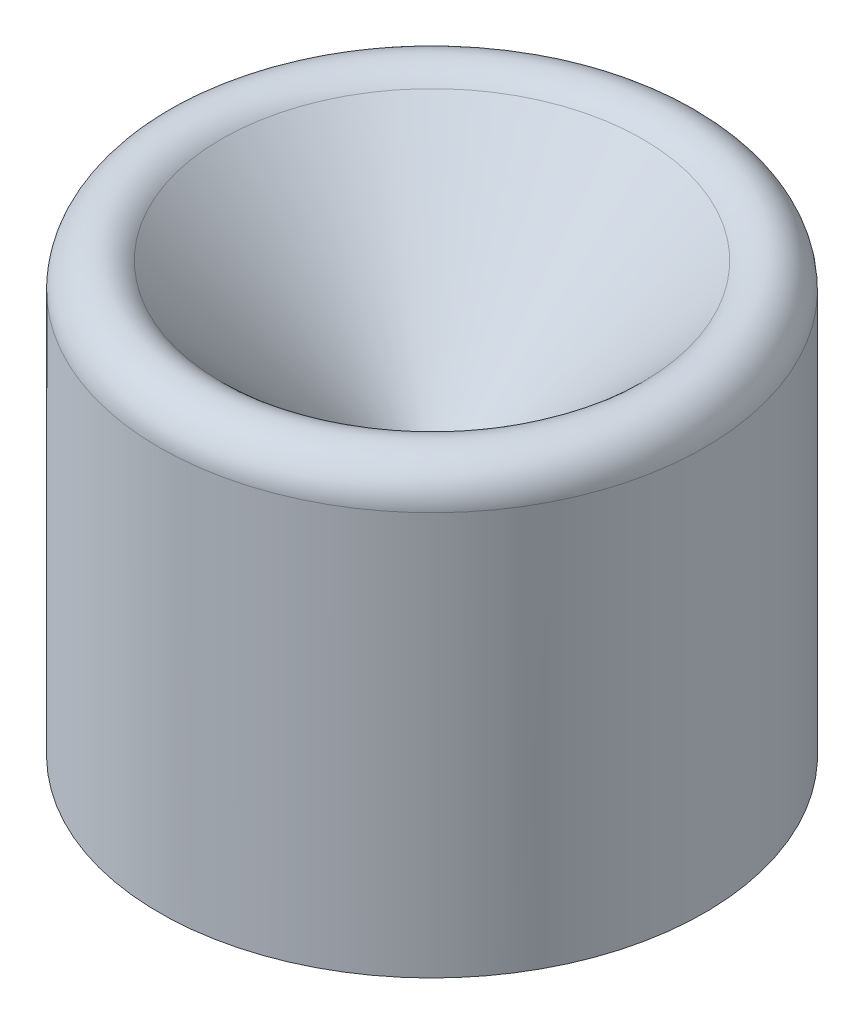
ISO-10303-21;
HEADER;
FILE_DESCRIPTION(('STEP AP214'),'2;1');
FILE_NAME('part.step','',(''),(''),'','','');
FILE_SCHEMA(('AUTOMOTIVE_DESIGN { 1 0 10303 214 1 1 1 1 }'));
ENDSEC;
DATA;
#1=APPLICATION_CONTEXT('core data for automotive mechanical design processes');
#2=APPLICATION_PROTOCOL_DEFINITION('international standard','automotive_design',2000,#1);
#3=PRODUCT_CONTEXT('',#1,'mechanical');
#4=PRODUCT('Part','Part','',(#3));
#5=PRODUCT_RELATED_PRODUCT_CATEGORY('part','',(#4));
#6=PRODUCT_DEFINITION_FORMATION('','',#4);
#7=PRODUCT_DEFINITION_CONTEXT('part definition',#1,'design');
#8=PRODUCT_DEFINITION('design','',#6,#7);
#9=PRODUCT_DEFINITION_SHAPE('','',#8);
#10=(LENGTH_UNIT() NAMED_UNIT(*) SI_UNIT(.MILLI.,.METRE.));
#11=(NAMED_UNIT(*) PLANE_ANGLE_UNIT() SI_UNIT($,.RADIAN.));
#12=(NAMED_UNIT(*) SI_UNIT($,.STERADIAN.) SOLID_ANGLE_UNIT());
#13=UNCERTAINTY_MEASURE_WITH_UNIT(LENGTH_MEASURE(1.E-05),#10,'distance_accuracy_value','');
#14=(GEOMETRIC_REPRESENTATION_CONTEXT(3) GLOBAL_UNCERTAINTY_ASSIGNED_CONTEXT((#13)) GLOBAL_UNIT_ASSIGNED_CONTEXT((#10,
#11,#12)) REPRESENTATION_CONTEXT('',''));
#15=CARTESIAN_POINT('',(0.,0.,0.));
#16=DIRECTION('',(0.,0.,1.));
#17=DIRECTION('',(1.,0.,0.));
#18=AXIS2_PLACEMENT_3D('',#15,#16,#17);
#19=CARTESIAN_POINT('',(0.,-6.,0.));
#20=DIRECTION('',(0.,-1.,0.));
#21=DIRECTION('',(0.,0.,-1.));
#22=AXIS2_PLACEMENT_3D('',#19,#20,#21);
#23=CYLINDRICAL_SURFACE('',#22,15.0000000000001);
#24=CARTESIAN_POINT('',(0.,10.1715728752538,0.));
#25=DIRECTION('',(0.,1.,0.));
#26=DIRECTION('',(0.,0.,1.));
#27=AXIS2_PLACEMENT_3D('',#24,#25,#26);
#28=CIRCLE('',#27,15.0000000000001);
#29=CARTESIAN_POINT('',(0.,10.1715728752538,15.0000000000001));
#30=VERTEX_POINT('',#29);
#31=EDGE_CURVE('E83',#30,#30,#28,.F.);
#32=ORIENTED_EDGE('',*,*,#31,.T.);
#33=EDGE_LOOP('',(#32));
#34=FACE_BOUND('',#33,.T.);
#35=CARTESIAN_POINT('',(0.,-12.,0.));
#36=DIRECTION('',(0.,-1.,0.));
#37=DIRECTION('',(0.,0.,-1.));
#38=AXIS2_PLACEMENT_3D('',#35,#36,#37);
#39=CIRCLE('',#38,15.0000000000001);
#40=CARTESIAN_POINT('',(0.,-12.,-15.0000000000001));
#41=VERTEX_POINT('',#40);
#42=EDGE_CURVE('E80',#41,#41,#39,.T.);
#43=ORIENTED_EDGE('',*,*,#42,.F.);
#44=EDGE_LOOP('',(#43));
#45=FACE_BOUND('',#44,.T.);
#46=ADVANCED_FACE('F33',(#34,#45),#23,.T.);
#47=CARTESIAN_POINT('',(0.,-12.,-15.0000000000001));
#48=DIRECTION('',(0.,-1.,0.));
#49=DIRECTION('',(0.,0.,-1.));
#50=AXIS2_PLACEMENT_3D('',#47,#48,#49);
#51=PLANE('',#50);
#52=CARTESIAN_POINT('',(0.,-12.,0.));
#53=DIRECTION('',(0.,-1.,0.));
#54=DIRECTION('',(0.,0.,-1.));
#55=AXIS2_PLACEMENT_3D('',#52,#53,#54);
#56=CIRCLE('',#55,4.);
#57=CARTESIAN_POINT('',(0.,-12.,-4.));
#58=VERTEX_POINT('',#57);
#59=EDGE_CURVE('E11',#58,#58,#56,.F.);
#60=ORIENTED_EDGE('',*,*,#59,.T.);
#61=EDGE_LOOP('',(#60));
#62=FACE_BOUND('',#61,.T.);
#63=ORIENTED_EDGE('',*,*,#42,.T.);
#64=EDGE_LOOP('',(#63));
#65=FACE_BOUND('',#64,.T.);
#66=ADVANCED_FACE('F59',(#62,#65),#51,.T.);
#67=CARTESIAN_POINT('',(0.,-6.,0.));
#68=DIRECTION('',(0.,-1.,0.));
#69=DIRECTION('',(0.,0.,-1.));
#70=AXIS2_PLACEMENT_3D('',#67,#68,#69);
#71=CYLINDRICAL_SURFACE('',#70,3.);
#72=CARTESIAN_POINT('',(0.,-11.,0.));
#73=DIRECTION('',(0.,-1.,0.));
#74=DIRECTION('',(0.,0.,-1.));
#75=AXIS2_PLACEMENT_3D('',#72,#73,#74);
#76=CIRCLE('',#75,3.);
#77=CARTESIAN_POINT('',(0.,-11.,-3.));
#78=VERTEX_POINT('',#77);
#79=EDGE_CURVE('E40',#78,#78,#76,.T.);
#80=ORIENTED_EDGE('',*,*,#79,.T.);
#81=EDGE_LOOP('',(#80));
#82=FACE_BOUND('',#81,.T.);
#83=CARTESIAN_POINT('',(0.,-6.,0.));
#84=DIRECTION('',(0.,-1.,0.));
#85=DIRECTION('',(0.,0.,-1.));
#86=AXIS2_PLACEMENT_3D('',#83,#84,#85);
#87=CIRCLE('',#86,3.);
#88=CARTESIAN_POINT('',(0.,-6.,-3.));
#89=VERTEX_POINT('',#88);
#90=EDGE_CURVE('E79',#89,#89,#87,.T.);
#91=ORIENTED_EDGE('',*,*,#90,.F.);
#92=EDGE_LOOP('',(#91));
#93=FACE_BOUND('',#92,.T.);
#94=ADVANCED_FACE('F54',(#82,#93),#71,.F.);
#95=CARTESIAN_POINT('',(0.,-6.,-3.));
#96=DIRECTION('',(0.,-1.,0.));
#97=DIRECTION('',(0.,0.,-1.));
#98=AXIS2_PLACEMENT_3D('',#95,#96,#97);
#99=PLANE('',#98);
#100=ORIENTED_EDGE('',*,*,#90,.T.);
#101=EDGE_LOOP('',(#100));
#102=FACE_BOUND('',#101,.T.);
#103=ADVANCED_FACE('F46',(#102),#99,.T.);
#104=CARTESIAN_POINT('',(0.,15.,0.));
#105=DIRECTION('',(0.,1.,0.));
#106=DIRECTION('',(0.,0.,1.));
#107=AXIS2_PLACEMENT_3D('',#104,#105,#106);
#108=CONICAL_SURFACE('',#107,15.,0.78539816339745);
#109=CARTESIAN_POINT('',(0.,11.5857864376269,0.));
#110=DIRECTION('',(0.,-1.,0.));
#111=DIRECTION('',(0.,0.,-1.));
#112=AXIS2_PLACEMENT_3D('',#109,#110,#111);
#113=CIRCLE('',#112,11.585786437627);
#114=CARTESIAN_POINT('',(0.,11.5857864376269,-11.585786437627));
#115=VERTEX_POINT('',#114);
#116=EDGE_CURVE('E87',#115,#115,#113,.F.);
#117=ORIENTED_EDGE('',*,*,#116,.T.);
#118=EDGE_LOOP('',(#117));
#119=FACE_BOUND('',#118,.T.);
#120=CARTESIAN_POINT('',(0.,0.,0.));
#121=VERTEX_POINT('',#120);
#122=VERTEX_LOOP('',#121);
#123=FACE_BOUND('',#122,.T.);
#124=ADVANCED_FACE('F43',(#119,#123),#108,.F.);
#125=CARTESIAN_POINT('',(0.,10.1715728752538,0.));
#126=DIRECTION('',(0.,1.,0.));
#127=DIRECTION('',(0.,0.,1.));
#128=AXIS2_PLACEMENT_3D('',#125,#126,#127);
#129=TOROIDAL_SURFACE('',#128,13.,2.);
#130=ORIENTED_EDGE('',*,*,#116,.F.);
#131=EDGE_LOOP('',(#130));
#132=FACE_BOUND('',#131,.T.);
#133=ORIENTED_EDGE('',*,*,#31,.F.);
#134=EDGE_LOOP('',(#133));
#135=FACE_BOUND('',#134,.T.);
#136=ADVANCED_FACE('F45',(#132,#135),#129,.T.);
#137=CARTESIAN_POINT('',(0.,-11.,0.));
#138=DIRECTION('',(0.,-1.,0.));
#139=DIRECTION('',(0.,0.,-1.));
#140=AXIS2_PLACEMENT_3D('',#137,#138,#139);
#141=CONICAL_SURFACE('',#140,3.,0.78539816339745);
#142=ORIENTED_EDGE('',*,*,#59,.F.);
#143=EDGE_LOOP('',(#142));
#144=FACE_BOUND('',#143,.T.);
#145=ORIENTED_EDGE('',*,*,#79,.F.);
#146=EDGE_LOOP('',(#145));
#147=FACE_BOUND('',#146,.T.);
#148=ADVANCED_FACE('F35',(#144,#147),#141,.F.);
#149=CLOSED_SHELL('',(#46,#66,#94,#103,#124,#136,#148));
#150=MANIFOLD_SOLID_BREP('B2',#149);
#151=ADVANCED_BREP_SHAPE_REPRESENTATION('',(#18,#150),#14);
#152=SHAPE_DEFINITION_REPRESENTATION(#9,#151);
ENDSEC;
END-ISO-10303-21;
